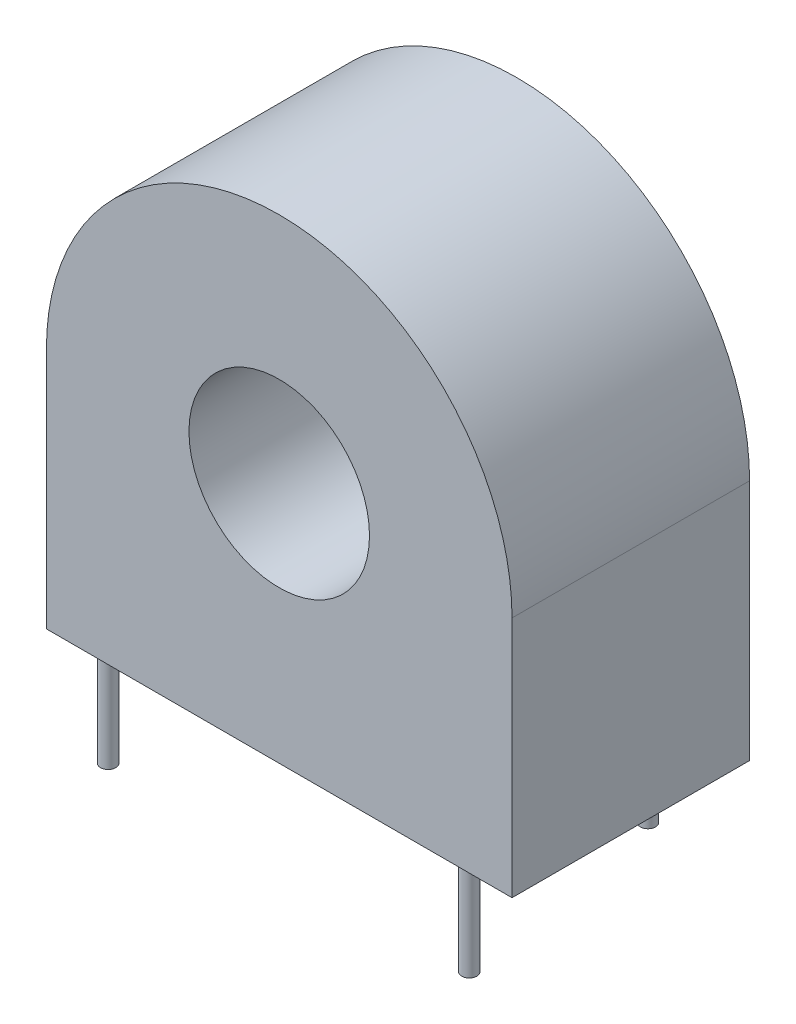
ISO-10303-21;
HEADER;
FILE_DESCRIPTION(('STEP AP214'),'2;1');
FILE_NAME('part.step','',(''),(''),'','','');
FILE_SCHEMA(('AUTOMOTIVE_DESIGN { 1 0 10303 214 1 1 1 1 }'));
ENDSEC;
DATA;
#1=APPLICATION_CONTEXT('core data for automotive mechanical design processes');
#2=APPLICATION_PROTOCOL_DEFINITION('international standard','automotive_design',2000,#1);
#3=PRODUCT_CONTEXT('',#1,'mechanical');
#4=PRODUCT('Part','Part','',(#3));
#5=PRODUCT_RELATED_PRODUCT_CATEGORY('part','',(#4));
#6=PRODUCT_DEFINITION_FORMATION('','',#4);
#7=PRODUCT_DEFINITION_CONTEXT('part definition',#1,'design');
#8=PRODUCT_DEFINITION('design','',#6,#7);
#9=PRODUCT_DEFINITION_SHAPE('','',#8);
#10=(LENGTH_UNIT() NAMED_UNIT(*) SI_UNIT(.MILLI.,.METRE.));
#11=(NAMED_UNIT(*) PLANE_ANGLE_UNIT() SI_UNIT($,.RADIAN.));
#12=(NAMED_UNIT(*) SI_UNIT($,.STERADIAN.) SOLID_ANGLE_UNIT());
#13=UNCERTAINTY_MEASURE_WITH_UNIT(LENGTH_MEASURE(1.E-05),#10,'distance_accuracy_value','');
#14=(GEOMETRIC_REPRESENTATION_CONTEXT(3) GLOBAL_UNCERTAINTY_ASSIGNED_CONTEXT((#13)) GLOBAL_UNIT_ASSIGNED_CONTEXT((#10,
#11,#12)) REPRESENTATION_CONTEXT('',''));
#15=CARTESIAN_POINT('',(0.,0.,0.));
#16=DIRECTION('',(0.,0.,1.));
#17=DIRECTION('',(1.,0.,0.));
#18=AXIS2_PLACEMENT_3D('',#15,#16,#17);
#19=CARTESIAN_POINT('',(0.,6.375,12.5));
#20=DIRECTION('',(0.,0.,1.));
#21=DIRECTION('',(1.,0.,0.));
#22=AXIS2_PLACEMENT_3D('',#19,#20,#21);
#23=PLANE('',#22);
#24=CARTESIAN_POINT('',(0.,6.375,12.5));
#25=DIRECTION('',(0.,0.,1.));
#26=DIRECTION('',(1.,0.,0.));
#27=AXIS2_PLACEMENT_3D('',#24,#25,#26);
#28=CIRCLE('',#27,12.25);
#29=CARTESIAN_POINT('',(12.25,6.375,12.5));
#30=VERTEX_POINT('',#29);
#31=CARTESIAN_POINT('',(-12.25,6.375,12.5));
#32=VERTEX_POINT('',#31);
#33=EDGE_CURVE('E86',#30,#32,#28,.T.);
#34=ORIENTED_EDGE('',*,*,#33,.T.);
#35=DIRECTION('',(0.,-1.,0.));
#36=VECTOR('',#35,1.);
#37=CARTESIAN_POINT('',(-12.25,-6.375,12.5));
#38=LINE('',#37,#36);
#39=CARTESIAN_POINT('',(-12.25,-6.375,12.5));
#40=VERTEX_POINT('',#39);
#41=EDGE_CURVE('E81',#32,#40,#38,.T.);
#42=ORIENTED_EDGE('',*,*,#41,.T.);
#43=DIRECTION('',(1.,0.,0.));
#44=VECTOR('',#43,1.);
#45=CARTESIAN_POINT('',(12.25,-6.375,12.5));
#46=LINE('',#45,#44);
#47=CARTESIAN_POINT('',(12.25,-6.375,12.5));
#48=VERTEX_POINT('',#47);
#49=EDGE_CURVE('E84',#40,#48,#46,.T.);
#50=ORIENTED_EDGE('',*,*,#49,.T.);
#51=DIRECTION('',(0.,1.,0.));
#52=VECTOR('',#51,1.);
#53=CARTESIAN_POINT('',(12.25,-6.375,12.5));
#54=LINE('',#53,#52);
#55=EDGE_CURVE('E50',#48,#30,#54,.T.);
#56=ORIENTED_EDGE('',*,*,#55,.T.);
#57=EDGE_LOOP('',(#34,#42,#50,#56));
#58=FACE_BOUND('',#57,.T.);
#59=CARTESIAN_POINT('',(0.,6.375,12.5));
#60=DIRECTION('',(0.,0.,1.));
#61=DIRECTION('',(1.,0.,0.));
#62=AXIS2_PLACEMENT_3D('',#59,#60,#61);
#63=CIRCLE('',#62,4.75);
#64=CARTESIAN_POINT('',(4.75,6.375,12.5));
#65=VERTEX_POINT('',#64);
#66=EDGE_CURVE('E104',#65,#65,#63,.T.);
#67=ORIENTED_EDGE('',*,*,#66,.F.);
#68=EDGE_LOOP('',(#67));
#69=FACE_BOUND('',#68,.T.);
#70=ADVANCED_FACE('F33',(#58,#69),#23,.T.);
#71=CARTESIAN_POINT('',(0.,6.375,0.));
#72=DIRECTION('',(0.,0.,1.));
#73=DIRECTION('',(1.,0.,0.));
#74=AXIS2_PLACEMENT_3D('',#71,#72,#73);
#75=PLANE('',#74);
#76=CARTESIAN_POINT('',(0.,6.375,0.));
#77=DIRECTION('',(0.,0.,1.));
#78=DIRECTION('',(1.,0.,0.));
#79=AXIS2_PLACEMENT_3D('',#76,#77,#78);
#80=CIRCLE('',#79,12.25);
#81=CARTESIAN_POINT('',(12.25,6.375,0.));
#82=VERTEX_POINT('',#81);
#83=CARTESIAN_POINT('',(-12.25,6.375,0.));
#84=VERTEX_POINT('',#83);
#85=EDGE_CURVE('E101',#82,#84,#80,.T.);
#86=ORIENTED_EDGE('',*,*,#85,.F.);
#87=DIRECTION('',(0.,1.,0.));
#88=VECTOR('',#87,1.);
#89=CARTESIAN_POINT('',(12.25,-6.375,0.));
#90=LINE('',#89,#88);
#91=CARTESIAN_POINT('',(12.25,-6.375,0.));
#92=VERTEX_POINT('',#91);
#93=EDGE_CURVE('E73',#92,#82,#90,.T.);
#94=ORIENTED_EDGE('',*,*,#93,.F.);
#95=DIRECTION('',(1.,0.,0.));
#96=VECTOR('',#95,1.);
#97=CARTESIAN_POINT('',(12.25,-6.375,0.));
#98=LINE('',#97,#96);
#99=CARTESIAN_POINT('',(-12.25,-6.375,0.));
#100=VERTEX_POINT('',#99);
#101=EDGE_CURVE('E67',#100,#92,#98,.T.);
#102=ORIENTED_EDGE('',*,*,#101,.F.);
#103=DIRECTION('',(0.,-1.,0.));
#104=VECTOR('',#103,1.);
#105=CARTESIAN_POINT('',(-12.25,-6.375,0.));
#106=LINE('',#105,#104);
#107=EDGE_CURVE('E91',#84,#100,#106,.T.);
#108=ORIENTED_EDGE('',*,*,#107,.F.);
#109=EDGE_LOOP('',(#86,#94,#102,#108));
#110=FACE_BOUND('',#109,.T.);
#111=CARTESIAN_POINT('',(0.,6.375,0.));
#112=DIRECTION('',(0.,0.,1.));
#113=DIRECTION('',(1.,0.,0.));
#114=AXIS2_PLACEMENT_3D('',#111,#112,#113);
#115=CIRCLE('',#114,4.75);
#116=CARTESIAN_POINT('',(4.75,6.375,0.));
#117=VERTEX_POINT('',#116);
#118=EDGE_CURVE('E167',#117,#117,#115,.T.);
#119=ORIENTED_EDGE('',*,*,#118,.T.);
#120=EDGE_LOOP('',(#119));
#121=FACE_BOUND('',#120,.T.);
#122=ADVANCED_FACE('F147',(#110,#121),#75,.F.);
#123=CARTESIAN_POINT('',(0.,6.375,12.5));
#124=DIRECTION('',(0.,0.,-1.));
#125=DIRECTION('',(-1.,0.,0.));
#126=AXIS2_PLACEMENT_3D('',#123,#124,#125);
#127=CYLINDRICAL_SURFACE('',#126,12.25);
#128=ORIENTED_EDGE('',*,*,#85,.T.);
#129=DIRECTION('',(0.,0.,-1.));
#130=VECTOR('',#129,1.);
#131=CARTESIAN_POINT('',(-12.25,6.375,12.5));
#132=LINE('',#131,#130);
#133=EDGE_CURVE('E92',#32,#84,#132,.T.);
#134=ORIENTED_EDGE('',*,*,#133,.F.);
#135=ORIENTED_EDGE('',*,*,#33,.F.);
#136=DIRECTION('',(0.,0.,-1.));
#137=VECTOR('',#136,1.);
#138=CARTESIAN_POINT('',(12.25,6.375,12.5));
#139=LINE('',#138,#137);
#140=EDGE_CURVE('E97',#30,#82,#139,.T.);
#141=ORIENTED_EDGE('',*,*,#140,.T.);
#142=EDGE_LOOP('',(#128,#134,#135,#141));
#143=FACE_BOUND('',#142,.T.);
#144=ADVANCED_FACE('F35',(#143),#127,.T.);
#145=CARTESIAN_POINT('',(-12.25,-6.375,12.5));
#146=DIRECTION('',(1.,0.,0.));
#147=DIRECTION('',(0.,1.,0.));
#148=AXIS2_PLACEMENT_3D('',#145,#146,#147);
#149=PLANE('',#148);
#150=ORIENTED_EDGE('',*,*,#107,.T.);
#151=DIRECTION('',(0.,0.,-1.));
#152=VECTOR('',#151,1.);
#153=CARTESIAN_POINT('',(-12.25,-6.375,12.5));
#154=LINE('',#153,#152);
#155=EDGE_CURVE('E89',#40,#100,#154,.T.);
#156=ORIENTED_EDGE('',*,*,#155,.F.);
#157=ORIENTED_EDGE('',*,*,#41,.F.);
#158=ORIENTED_EDGE('',*,*,#133,.T.);
#159=EDGE_LOOP('',(#150,#156,#157,#158));
#160=FACE_BOUND('',#159,.T.);
#161=ADVANCED_FACE('F90',(#160),#149,.F.);
#162=CARTESIAN_POINT('',(12.25,-6.375,12.5));
#163=DIRECTION('',(0.,1.,0.));
#164=DIRECTION('',(-1.,0.,0.));
#165=AXIS2_PLACEMENT_3D('',#162,#163,#164);
#166=PLANE('',#165);
#167=CARTESIAN_POINT('',(-9.5,-6.375,12.));
#168=DIRECTION('',(0.,1.,0.));
#169=DIRECTION('',(-1.,0.,0.));
#170=AXIS2_PLACEMENT_3D('',#167,#168,#169);
#171=CIRCLE('',#170,0.399999999999999);
#172=CARTESIAN_POINT('',(-9.9,-6.375,12.));
#173=VERTEX_POINT('',#172);
#174=EDGE_CURVE('E11',#173,#173,#171,.F.);
#175=ORIENTED_EDGE('',*,*,#174,.F.);
#176=EDGE_LOOP('',(#175));
#177=FACE_BOUND('',#176,.T.);
#178=CARTESIAN_POINT('',(9.5,-6.375,12.));
#179=DIRECTION('',(0.,1.,0.));
#180=DIRECTION('',(-1.,0.,0.));
#181=AXIS2_PLACEMENT_3D('',#178,#179,#180);
#182=CIRCLE('',#181,0.399999999999999);
#183=CARTESIAN_POINT('',(9.1,-6.375,12.));
#184=VERTEX_POINT('',#183);
#185=EDGE_CURVE('E42',#184,#184,#182,.F.);
#186=ORIENTED_EDGE('',*,*,#185,.F.);
#187=EDGE_LOOP('',(#186));
#188=FACE_BOUND('',#187,.T.);
#189=CARTESIAN_POINT('',(-7.4,-6.375,0.499999999999945));
#190=DIRECTION('',(0.,1.,0.));
#191=DIRECTION('',(-1.,0.,0.));
#192=AXIS2_PLACEMENT_3D('',#189,#190,#191);
#193=CIRCLE('',#192,0.4);
#194=CARTESIAN_POINT('',(-7.8,-6.375,0.499999999999945));
#195=VERTEX_POINT('',#194);
#196=EDGE_CURVE('E114',#195,#195,#193,.F.);
#197=ORIENTED_EDGE('',*,*,#196,.F.);
#198=EDGE_LOOP('',(#197));
#199=FACE_BOUND('',#198,.T.);
#200=CARTESIAN_POINT('',(7.4,-6.375,0.499999999999945));
#201=DIRECTION('',(0.,1.,0.));
#202=DIRECTION('',(-1.,0.,0.));
#203=AXIS2_PLACEMENT_3D('',#200,#201,#202);
#204=CIRCLE('',#203,0.4);
#205=CARTESIAN_POINT('',(7.,-6.375,0.499999999999945));
#206=VERTEX_POINT('',#205);
#207=EDGE_CURVE('E111',#206,#206,#204,.F.);
#208=ORIENTED_EDGE('',*,*,#207,.F.);
#209=EDGE_LOOP('',(#208));
#210=FACE_BOUND('',#209,.T.);
#211=ORIENTED_EDGE('',*,*,#101,.T.);
#212=DIRECTION('',(0.,0.,-1.));
#213=VECTOR('',#212,1.);
#214=CARTESIAN_POINT('',(12.25,-6.375,12.5));
#215=LINE('',#214,#213);
#216=EDGE_CURVE('E93',#48,#92,#215,.T.);
#217=ORIENTED_EDGE('',*,*,#216,.F.);
#218=ORIENTED_EDGE('',*,*,#49,.F.);
#219=ORIENTED_EDGE('',*,*,#155,.T.);
#220=EDGE_LOOP('',(#211,#217,#218,#219));
#221=FACE_BOUND('',#220,.T.);
#222=ADVANCED_FACE('F95',(#177,#188,#199,#210,#221),#166,.F.);
#223=CARTESIAN_POINT('',(12.25,-6.375,12.5));
#224=DIRECTION('',(-1.,0.,0.));
#225=DIRECTION('',(0.,0.,1.));
#226=AXIS2_PLACEMENT_3D('',#223,#224,#225);
#227=PLANE('',#226);
#228=ORIENTED_EDGE('',*,*,#93,.T.);
#229=ORIENTED_EDGE('',*,*,#140,.F.);
#230=ORIENTED_EDGE('',*,*,#55,.F.);
#231=ORIENTED_EDGE('',*,*,#216,.T.);
#232=EDGE_LOOP('',(#228,#229,#230,#231));
#233=FACE_BOUND('',#232,.T.);
#234=ADVANCED_FACE('F123',(#233),#227,.F.);
#235=CARTESIAN_POINT('',(0.,6.375,12.5));
#236=DIRECTION('',(0.,0.,-1.));
#237=DIRECTION('',(-1.,0.,0.));
#238=AXIS2_PLACEMENT_3D('',#235,#236,#237);
#239=CYLINDRICAL_SURFACE('',#238,4.75);
#240=ORIENTED_EDGE('',*,*,#66,.T.);
#241=EDGE_LOOP('',(#240));
#242=FACE_BOUND('',#241,.T.);
#243=ORIENTED_EDGE('',*,*,#118,.F.);
#244=EDGE_LOOP('',(#243));
#245=FACE_BOUND('',#244,.T.);
#246=ADVANCED_FACE('F133',(#242,#245),#239,.F.);
#247=CARTESIAN_POINT('',(7.4,-11.375,0.499999999999945));
#248=DIRECTION('',(0.,1.,0.));
#249=DIRECTION('',(-1.,0.,0.));
#250=AXIS2_PLACEMENT_3D('',#247,#248,#249);
#251=CYLINDRICAL_SURFACE('',#250,0.4);
#252=CARTESIAN_POINT('',(7.4,-11.375,0.499999999999945));
#253=DIRECTION('',(0.,-1.,0.));
#254=DIRECTION('',(1.,0.,0.));
#255=AXIS2_PLACEMENT_3D('',#252,#253,#254);
#256=CIRCLE('',#255,0.4);
#257=CARTESIAN_POINT('',(7.8,-11.375,0.499999999999945));
#258=VERTEX_POINT('',#257);
#259=EDGE_CURVE('E169',#258,#258,#256,.T.);
#260=ORIENTED_EDGE('',*,*,#259,.F.);
#261=EDGE_LOOP('',(#260));
#262=FACE_BOUND('',#261,.T.);
#263=ORIENTED_EDGE('',*,*,#207,.T.);
#264=EDGE_LOOP('',(#263));
#265=FACE_BOUND('',#264,.T.);
#266=ADVANCED_FACE('F130',(#262,#265),#251,.T.);
#267=CARTESIAN_POINT('',(7.4,-11.375,0.499999999999945));
#268=DIRECTION('',(0.,-1.,0.));
#269=DIRECTION('',(1.,0.,0.));
#270=AXIS2_PLACEMENT_3D('',#267,#268,#269);
#271=PLANE('',#270);
#272=ORIENTED_EDGE('',*,*,#259,.T.);
#273=EDGE_LOOP('',(#272));
#274=FACE_BOUND('',#273,.T.);
#275=ADVANCED_FACE('F132',(#274),#271,.T.);
#276=CARTESIAN_POINT('',(-7.4,-11.375,0.499999999999945));
#277=DIRECTION('',(0.,1.,0.));
#278=DIRECTION('',(-1.,0.,0.));
#279=AXIS2_PLACEMENT_3D('',#276,#277,#278);
#280=CYLINDRICAL_SURFACE('',#279,0.4);
#281=CARTESIAN_POINT('',(-7.4,-11.375,0.499999999999945));
#282=DIRECTION('',(0.,-1.,0.));
#283=DIRECTION('',(1.,0.,0.));
#284=AXIS2_PLACEMENT_3D('',#281,#282,#283);
#285=CIRCLE('',#284,0.4);
#286=CARTESIAN_POINT('',(-7.,-11.375,0.499999999999945));
#287=VERTEX_POINT('',#286);
#288=EDGE_CURVE('E174',#287,#287,#285,.T.);
#289=ORIENTED_EDGE('',*,*,#288,.F.);
#290=EDGE_LOOP('',(#289));
#291=FACE_BOUND('',#290,.T.);
#292=ORIENTED_EDGE('',*,*,#196,.T.);
#293=EDGE_LOOP('',(#292));
#294=FACE_BOUND('',#293,.T.);
#295=ADVANCED_FACE('F140',(#291,#294),#280,.T.);
#296=CARTESIAN_POINT('',(-7.4,-11.375,0.499999999999945));
#297=DIRECTION('',(0.,-1.,0.));
#298=DIRECTION('',(1.,0.,0.));
#299=AXIS2_PLACEMENT_3D('',#296,#297,#298);
#300=PLANE('',#299);
#301=ORIENTED_EDGE('',*,*,#288,.T.);
#302=EDGE_LOOP('',(#301));
#303=FACE_BOUND('',#302,.T.);
#304=ADVANCED_FACE('F204',(#303),#300,.T.);
#305=CARTESIAN_POINT('',(9.5,-11.375,12.));
#306=DIRECTION('',(0.,1.,0.));
#307=DIRECTION('',(-1.,0.,0.));
#308=AXIS2_PLACEMENT_3D('',#305,#306,#307);
#309=CYLINDRICAL_SURFACE('',#308,0.399999999999999);
#310=CARTESIAN_POINT('',(9.5,-11.375,12.));
#311=DIRECTION('',(0.,-1.,0.));
#312=DIRECTION('',(1.,0.,0.));
#313=AXIS2_PLACEMENT_3D('',#310,#311,#312);
#314=CIRCLE('',#313,0.399999999999999);
#315=CARTESIAN_POINT('',(9.9,-11.375,12.));
#316=VERTEX_POINT('',#315);
#317=EDGE_CURVE('E179',#316,#316,#314,.T.);
#318=ORIENTED_EDGE('',*,*,#317,.F.);
#319=EDGE_LOOP('',(#318));
#320=FACE_BOUND('',#319,.T.);
#321=ORIENTED_EDGE('',*,*,#185,.T.);
#322=EDGE_LOOP('',(#321));
#323=FACE_BOUND('',#322,.T.);
#324=ADVANCED_FACE('F119',(#320,#323),#309,.T.);
#325=CARTESIAN_POINT('',(9.5,-11.375,12.));
#326=DIRECTION('',(0.,-1.,0.));
#327=DIRECTION('',(1.,0.,0.));
#328=AXIS2_PLACEMENT_3D('',#325,#326,#327);
#329=PLANE('',#328);
#330=ORIENTED_EDGE('',*,*,#317,.T.);
#331=EDGE_LOOP('',(#330));
#332=FACE_BOUND('',#331,.T.);
#333=ADVANCED_FACE('F191',(#332),#329,.T.);
#334=CARTESIAN_POINT('',(-9.5,-11.375,12.));
#335=DIRECTION('',(0.,1.,0.));
#336=DIRECTION('',(-1.,0.,0.));
#337=AXIS2_PLACEMENT_3D('',#334,#335,#336);
#338=CYLINDRICAL_SURFACE('',#337,0.399999999999999);
#339=CARTESIAN_POINT('',(-9.5,-11.375,12.));
#340=DIRECTION('',(0.,-1.,0.));
#341=DIRECTION('',(1.,0.,0.));
#342=AXIS2_PLACEMENT_3D('',#339,#340,#341);
#343=CIRCLE('',#342,0.399999999999999);
#344=CARTESIAN_POINT('',(-9.1,-11.375,12.));
#345=VERTEX_POINT('',#344);
#346=EDGE_CURVE('E182',#345,#345,#343,.T.);
#347=ORIENTED_EDGE('',*,*,#346,.F.);
#348=EDGE_LOOP('',(#347));
#349=FACE_BOUND('',#348,.T.);
#350=ORIENTED_EDGE('',*,*,#174,.T.);
#351=EDGE_LOOP('',(#350));
#352=FACE_BOUND('',#351,.T.);
#353=ADVANCED_FACE('F188',(#349,#352),#338,.T.);
#354=CARTESIAN_POINT('',(-9.5,-11.375,12.));
#355=DIRECTION('',(0.,-1.,0.));
#356=DIRECTION('',(1.,0.,0.));
#357=AXIS2_PLACEMENT_3D('',#354,#355,#356);
#358=PLANE('',#357);
#359=ORIENTED_EDGE('',*,*,#346,.T.);
#360=EDGE_LOOP('',(#359));
#361=FACE_BOUND('',#360,.T.);
#362=ADVANCED_FACE('F186',(#361),#358,.T.);
#363=CLOSED_SHELL('',(#70,#122,#144,#161,#222,#234,#246,#266,#275,#295,#304,#324,#333,#353,#362));
#364=MANIFOLD_SOLID_BREP('B2',#363);
#365=ADVANCED_BREP_SHAPE_REPRESENTATION('',(#18,#364),#14);
#366=SHAPE_DEFINITION_REPRESENTATION(#9,#365);
ENDSEC;
END-ISO-10303-21;
